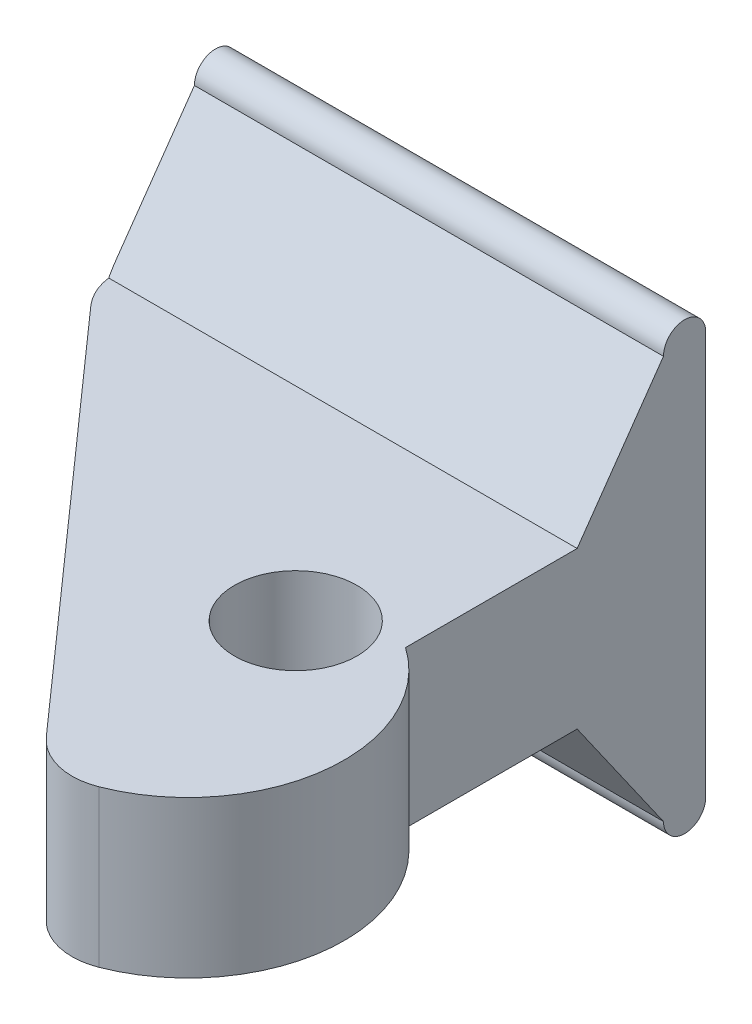
ISO-10303-21;
HEADER;
FILE_DESCRIPTION(('STEP AP214'),'2;1');
FILE_NAME('part.step','',(''),(''),'','','');
FILE_SCHEMA(('AUTOMOTIVE_DESIGN { 1 0 10303 214 1 1 1 1 }'));
ENDSEC;
DATA;
#1=APPLICATION_CONTEXT('core data for automotive mechanical design processes');
#2=APPLICATION_PROTOCOL_DEFINITION('international standard','automotive_design',2000,#1);
#3=PRODUCT_CONTEXT('',#1,'mechanical');
#4=PRODUCT('Part','Part','',(#3));
#5=PRODUCT_RELATED_PRODUCT_CATEGORY('part','',(#4));
#6=PRODUCT_DEFINITION_FORMATION('','',#4);
#7=PRODUCT_DEFINITION_CONTEXT('part definition',#1,'design');
#8=PRODUCT_DEFINITION('design','',#6,#7);
#9=PRODUCT_DEFINITION_SHAPE('','',#8);
#10=(LENGTH_UNIT() NAMED_UNIT(*) SI_UNIT(.MILLI.,.METRE.));
#11=(NAMED_UNIT(*) PLANE_ANGLE_UNIT() SI_UNIT($,.RADIAN.));
#12=(NAMED_UNIT(*) SI_UNIT($,.STERADIAN.) SOLID_ANGLE_UNIT());
#13=UNCERTAINTY_MEASURE_WITH_UNIT(LENGTH_MEASURE(1.E-05),#10,'distance_accuracy_value','');
#14=(GEOMETRIC_REPRESENTATION_CONTEXT(3) GLOBAL_UNCERTAINTY_ASSIGNED_CONTEXT((#13)) GLOBAL_UNIT_ASSIGNED_CONTEXT((#10,
#11,#12)) REPRESENTATION_CONTEXT('',''));
#15=CARTESIAN_POINT('',(0.,0.,0.));
#16=DIRECTION('',(0.,0.,1.));
#17=DIRECTION('',(1.,0.,0.));
#18=AXIS2_PLACEMENT_3D('',#15,#16,#17);
#19=CARTESIAN_POINT('',(12.7,6.35,0.));
#20=DIRECTION('',(-1.,0.,0.));
#21=DIRECTION('',(0.,0.,1.));
#22=AXIS2_PLACEMENT_3D('',#19,#20,#21);
#23=PLANE('',#22);
#24=DIRECTION('',(0.,0.,-1.));
#25=VECTOR('',#24,1.);
#26=CARTESIAN_POINT('',(12.7,0.,0.));
#27=LINE('',#26,#25);
#28=CARTESIAN_POINT('',(12.7,0.,6.35000000000004));
#29=VERTEX_POINT('',#28);
#30=CARTESIAN_POINT('',(12.7,0.,-0.620153491090818));
#31=VERTEX_POINT('',#30);
#32=EDGE_CURVE('E146',#29,#31,#27,.T.);
#33=ORIENTED_EDGE('',*,*,#32,.T.);
#34=DIRECTION('',(0.,-0.819152044288993,-0.573576436351044));
#35=VECTOR('',#34,1.);
#36=CARTESIAN_POINT('',(12.7,4.55229078472536,2.56739483249647));
#37=LINE('',#36,#35);
#38=CARTESIAN_POINT('',(12.7,-5.00602262218575,-4.12540826759358));
#39=VERTEX_POINT('',#38);
#40=EDGE_CURVE('E143',#31,#39,#37,.T.);
#41=ORIENTED_EDGE('',*,*,#40,.T.);
#42=CARTESIAN_POINT('',(12.7,-5.00602262218575,-4.98370413379679));
#43=DIRECTION('',(-1.,0.,0.));
#44=DIRECTION('',(0.,0.,1.));
#45=AXIS2_PLACEMENT_3D('',#42,#43,#44);
#46=CIRCLE('',#45,0.858295866203211);
#47=CARTESIAN_POINT('',(12.7,-5.00602262218575,-5.842));
#48=VERTEX_POINT('',#47);
#49=EDGE_CURVE('E134',#48,#39,#46,.T.);
#50=ORIENTED_EDGE('',*,*,#49,.F.);
#51=DIRECTION('',(0.,-1.,0.));
#52=VECTOR('',#51,1.);
#53=CARTESIAN_POINT('',(12.7,6.35,-5.842));
#54=LINE('',#53,#52);
#55=CARTESIAN_POINT('',(12.7,11.3560226221857,-5.842));
#56=VERTEX_POINT('',#55);
#57=EDGE_CURVE('E118',#56,#48,#54,.T.);
#58=ORIENTED_EDGE('',*,*,#57,.F.);
#59=CARTESIAN_POINT('',(12.7,11.3560226221857,-4.9837041337968));
#60=DIRECTION('',(-1.,0.,0.));
#61=DIRECTION('',(0.,0.,1.));
#62=AXIS2_PLACEMENT_3D('',#59,#60,#61);
#63=CIRCLE('',#62,0.858295866203201);
#64=CARTESIAN_POINT('',(12.7,11.3560226221857,-4.1254082675936));
#65=VERTEX_POINT('',#64);
#66=EDGE_CURVE('E128',#56,#65,#63,.F.);
#67=ORIENTED_EDGE('',*,*,#66,.T.);
#68=DIRECTION('',(0.,-0.819152044288991,0.573576436351047));
#69=VECTOR('',#68,1.);
#70=CARTESIAN_POINT('',(12.7,6.05862317033365,-0.416129238498795));
#71=LINE('',#70,#69);
#72=CARTESIAN_POINT('',(12.7,6.35,-0.620153491090819));
#73=VERTEX_POINT('',#72);
#74=EDGE_CURVE('E148',#65,#73,#71,.T.);
#75=ORIENTED_EDGE('',*,*,#74,.T.);
#76=DIRECTION('',(0.,0.,-1.));
#77=VECTOR('',#76,1.);
#78=CARTESIAN_POINT('',(12.7,6.35,0.));
#79=LINE('',#78,#77);
#80=CARTESIAN_POINT('',(12.7,6.35,6.35000000000004));
#81=VERTEX_POINT('',#80);
#82=EDGE_CURVE('E154',#81,#73,#79,.T.);
#83=ORIENTED_EDGE('',*,*,#82,.F.);
#84=DIRECTION('',(0.,-1.,0.));
#85=VECTOR('',#84,1.);
#86=CARTESIAN_POINT('',(12.7,6.35,6.35000000000004));
#87=LINE('',#86,#85);
#88=EDGE_CURVE('E155',#81,#29,#87,.T.);
#89=ORIENTED_EDGE('',*,*,#88,.T.);
#90=EDGE_LOOP('',(#33,#41,#50,#58,#67,#75,#83,#89));
#91=FACE_BOUND('',#90,.T.);
#92=ADVANCED_FACE('F36',(#91),#23,.F.);
#93=CARTESIAN_POINT('',(-6.35,12.9055102958205,0.));
#94=DIRECTION('',(1.,0.,0.));
#95=DIRECTION('',(0.,0.,-1.));
#96=AXIS2_PLACEMENT_3D('',#93,#94,#95);
#97=PLANE('',#96);
#98=DIRECTION('',(0.,0.819152044288993,0.573576436351044));
#99=VECTOR('',#98,1.);
#100=CARTESIAN_POINT('',(-6.35,8.95110421811033,5.64747715773074));
#101=LINE('',#100,#99);
#102=CARTESIAN_POINT('',(-6.35,-5.00602262218575,-4.12540826759358));
#103=VERTEX_POINT('',#102);
#104=CARTESIAN_POINT('',(-6.35,-0.491776970305034,-0.964499432816318));
#105=VERTEX_POINT('',#104);
#106=EDGE_CURVE('E164',#103,#105,#101,.T.);
#107=ORIENTED_EDGE('',*,*,#106,.T.);
#108=DIRECTION('',(0.,-1.,0.));
#109=VECTOR('',#108,1.);
#110=CARTESIAN_POINT('',(-6.35,12.9055102958205,-0.964499432816318));
#111=LINE('',#110,#109);
#112=CARTESIAN_POINT('',(-6.35,6.841776970305,-0.964499432816317));
#113=VERTEX_POINT('',#112);
#114=EDGE_CURVE('E44',#105,#113,#111,.F.);
#115=ORIENTED_EDGE('',*,*,#114,.T.);
#116=DIRECTION('',(0.,0.819152044288991,-0.573576436351047));
#117=VECTOR('',#116,1.);
#118=CARTESIAN_POINT('',(-6.35,10.4574366037186,-3.4962115637331));
#119=LINE('',#118,#117);
#120=CARTESIAN_POINT('',(-6.35,11.3560226221857,-4.1254082675936));
#121=VERTEX_POINT('',#120);
#122=EDGE_CURVE('E161',#113,#121,#119,.T.);
#123=ORIENTED_EDGE('',*,*,#122,.T.);
#124=CARTESIAN_POINT('',(-6.35,11.3560226221857,-4.9837041337968));
#125=DIRECTION('',(-1.,0.,0.));
#126=DIRECTION('',(0.,0.,1.));
#127=AXIS2_PLACEMENT_3D('',#124,#125,#126);
#128=CIRCLE('',#127,0.858295866203201);
#129=CARTESIAN_POINT('',(-6.35,11.3560226221857,-5.842));
#130=VERTEX_POINT('',#129);
#131=EDGE_CURVE('E163',#121,#130,#128,.T.);
#132=ORIENTED_EDGE('',*,*,#131,.T.);
#133=DIRECTION('',(0.,1.,0.));
#134=VECTOR('',#133,1.);
#135=CARTESIAN_POINT('',(-6.35,0.,-5.842));
#136=LINE('',#135,#134);
#137=CARTESIAN_POINT('',(-6.35,-5.00602262218575,-5.842));
#138=VERTEX_POINT('',#137);
#139=EDGE_CURVE('E160',#138,#130,#136,.T.);
#140=ORIENTED_EDGE('',*,*,#139,.F.);
#141=CARTESIAN_POINT('',(-6.35,-5.00602262218575,-4.98370413379679));
#142=DIRECTION('',(-1.,0.,0.));
#143=DIRECTION('',(0.,0.,1.));
#144=AXIS2_PLACEMENT_3D('',#141,#142,#143);
#145=CIRCLE('',#144,0.858295866203211);
#146=EDGE_CURVE('E137',#103,#138,#145,.F.);
#147=ORIENTED_EDGE('',*,*,#146,.F.);
#148=EDGE_LOOP('',(#107,#115,#123,#132,#140,#147));
#149=FACE_BOUND('',#148,.T.);
#150=ADVANCED_FACE('F238',(#149),#97,.F.);
#151=CARTESIAN_POINT('',(9.06408672353238,6.35,11.5560190785289));
#152=DIRECTION('',(0.,1.,0.));
#153=DIRECTION('',(0.,0.,1.));
#154=AXIS2_PLACEMENT_3D('',#151,#152,#153);
#155=PLANE('',#154);
#156=DIRECTION('',(-0.663742969789503,0.,-0.747960740985121));
#157=VECTOR('',#156,1.);
#158=CARTESIAN_POINT('',(6.17777705205215,6.35,14.117340345949));
#159=LINE('',#158,#157);
#160=CARTESIAN_POINT('',(8.55028345385277,6.35,16.790877734745));
#161=VERTEX_POINT('',#160);
#162=CARTESIAN_POINT('',(-5.7098202821022,6.35,0.721407710449019));
#163=VERTEX_POINT('',#162);
#164=EDGE_CURVE('E174',#161,#163,#159,.T.);
#165=ORIENTED_EDGE('',*,*,#164,.F.);
#166=CARTESIAN_POINT('',(10.450103735955,6.35,15.1049705914796));
#167=DIRECTION('',(0.,1.,0.));
#168=DIRECTION('',(0.,0.,1.));
#169=AXIS2_PLACEMENT_3D('',#166,#167,#168);
#170=CIRCLE('',#169,2.54);
#171=CARTESIAN_POINT('',(11.37411507757,6.35,17.4709382667801));
#172=VERTEX_POINT('',#171);
#173=EDGE_CURVE('E188',#161,#172,#170,.T.);
#174=ORIENTED_EDGE('',*,*,#173,.T.);
#175=CARTESIAN_POINT('',(9.06408672353238,6.35,11.5560190785289));
#176=DIRECTION('',(0.,1.,0.));
#177=DIRECTION('',(0.,0.,1.));
#178=AXIS2_PLACEMENT_3D('',#175,#176,#177);
#179=CIRCLE('',#178,6.35);
#180=EDGE_CURVE('E152',#172,#81,#179,.T.);
#181=ORIENTED_EDGE('',*,*,#180,.T.);
#182=ORIENTED_EDGE('',*,*,#82,.T.);
#183=DIRECTION('',(-1.,0.,0.));
#184=VECTOR('',#183,1.);
#185=CARTESIAN_POINT('',(15.4140867235324,6.35,-0.620153491090819));
#186=LINE('',#185,#184);
#187=CARTESIAN_POINT('',(-6.32655039139238,6.35,-0.620153491090819));
#188=VERTEX_POINT('',#187);
#189=EDGE_CURVE('E222',#73,#188,#186,.T.);
#190=ORIENTED_EDGE('',*,*,#189,.T.);
#191=CARTESIAN_POINT('',(-3.81,6.35,-0.964499432816318));
#192=DIRECTION('',(0.,1.,0.));
#193=DIRECTION('',(0.,0.,1.));
#194=AXIS2_PLACEMENT_3D('',#191,#192,#193);
#195=CIRCLE('',#194,2.54);
#196=EDGE_CURVE('E186',#188,#163,#195,.T.);
#197=ORIENTED_EDGE('',*,*,#196,.T.);
#198=EDGE_LOOP('',(#165,#174,#181,#182,#190,#197));
#199=FACE_BOUND('',#198,.T.);
#200=CARTESIAN_POINT('',(9.52499999999998,6.35,7.63484650890918));
#201=DIRECTION('',(0.,1.,0.));
#202=DIRECTION('',(0.,0.,1.));
#203=AXIS2_PLACEMENT_3D('',#200,#201,#202);
#204=CIRCLE('',#203,2.4892);
#205=CARTESIAN_POINT('',(9.52499999999998,6.35,10.1240465089092));
#206=VERTEX_POINT('',#205);
#207=EDGE_CURVE('E139',#206,#206,#204,.T.);
#208=ORIENTED_EDGE('',*,*,#207,.F.);
#209=EDGE_LOOP('',(#208));
#210=FACE_BOUND('',#209,.T.);
#211=ADVANCED_FACE('F194',(#199,#210),#155,.T.);
#212=CARTESIAN_POINT('',(9.06408672353238,0.,11.5560190785289));
#213=DIRECTION('',(0.,1.,0.));
#214=DIRECTION('',(0.,0.,1.));
#215=AXIS2_PLACEMENT_3D('',#212,#213,#214);
#216=PLANE('',#215);
#217=CARTESIAN_POINT('',(9.52499999999998,0.,7.63484650890918));
#218=DIRECTION('',(0.,1.,0.));
#219=DIRECTION('',(0.,0.,1.));
#220=AXIS2_PLACEMENT_3D('',#217,#218,#219);
#221=CIRCLE('',#220,2.4892);
#222=CARTESIAN_POINT('',(9.52499999999998,0.,10.1240465089092));
#223=VERTEX_POINT('',#222);
#224=EDGE_CURVE('E171',#223,#223,#221,.T.);
#225=ORIENTED_EDGE('',*,*,#224,.T.);
#226=EDGE_LOOP('',(#225));
#227=FACE_BOUND('',#226,.T.);
#228=CARTESIAN_POINT('',(9.06408672353238,0.,11.5560190785289));
#229=DIRECTION('',(0.,1.,0.));
#230=DIRECTION('',(0.,0.,1.));
#231=AXIS2_PLACEMENT_3D('',#228,#229,#230);
#232=CIRCLE('',#231,6.35);
#233=CARTESIAN_POINT('',(11.37411507757,0.,17.4709382667801));
#234=VERTEX_POINT('',#233);
#235=EDGE_CURVE('E144',#234,#29,#232,.T.);
#236=ORIENTED_EDGE('',*,*,#235,.F.);
#237=CARTESIAN_POINT('',(10.450103735955,0.,15.1049705914796));
#238=DIRECTION('',(0.,1.,0.));
#239=DIRECTION('',(0.,0.,1.));
#240=AXIS2_PLACEMENT_3D('',#237,#238,#239);
#241=CIRCLE('',#240,2.54);
#242=CARTESIAN_POINT('',(8.55028345385277,0.,16.790877734745));
#243=VERTEX_POINT('',#242);
#244=EDGE_CURVE('E179',#234,#243,#241,.F.);
#245=ORIENTED_EDGE('',*,*,#244,.T.);
#246=DIRECTION('',(-0.663742969789503,0.,-0.747960740985121));
#247=VECTOR('',#246,1.);
#248=CARTESIAN_POINT('',(6.17777705205215,0.,14.117340345949));
#249=LINE('',#248,#247);
#250=CARTESIAN_POINT('',(-5.7098202821022,0.,0.721407710449019));
#251=VERTEX_POINT('',#250);
#252=EDGE_CURVE('E210',#243,#251,#249,.T.);
#253=ORIENTED_EDGE('',*,*,#252,.T.);
#254=CARTESIAN_POINT('',(-3.81,0.,-0.964499432816318));
#255=DIRECTION('',(0.,1.,0.));
#256=DIRECTION('',(0.,0.,1.));
#257=AXIS2_PLACEMENT_3D('',#254,#255,#256);
#258=CIRCLE('',#257,2.54);
#259=CARTESIAN_POINT('',(-6.32655039139238,0.,-0.620153491090818));
#260=VERTEX_POINT('',#259);
#261=EDGE_CURVE('E177',#251,#260,#258,.F.);
#262=ORIENTED_EDGE('',*,*,#261,.T.);
#263=DIRECTION('',(-1.,0.,0.));
#264=VECTOR('',#263,1.);
#265=CARTESIAN_POINT('',(15.4140867235324,0.,-0.620153491090818));
#266=LINE('',#265,#264);
#267=EDGE_CURVE('E220',#31,#260,#266,.T.);
#268=ORIENTED_EDGE('',*,*,#267,.F.);
#269=ORIENTED_EDGE('',*,*,#32,.F.);
#270=EDGE_LOOP('',(#236,#245,#253,#262,#268,#269));
#271=FACE_BOUND('',#270,.T.);
#272=ADVANCED_FACE('F209',(#227,#271),#216,.F.);
#273=CARTESIAN_POINT('',(9.06408672353238,6.35,11.5560190785289));
#274=DIRECTION('',(0.,-1.,0.));
#275=DIRECTION('',(0.,0.,-1.));
#276=AXIS2_PLACEMENT_3D('',#273,#274,#275);
#277=CYLINDRICAL_SURFACE('',#276,6.35);
#278=ORIENTED_EDGE('',*,*,#180,.F.);
#279=DIRECTION('',(0.,-1.,0.));
#280=VECTOR('',#279,1.);
#281=CARTESIAN_POINT('',(11.37411507757,6.35,17.4709382667801));
#282=LINE('',#281,#280);
#283=EDGE_CURVE('E166',#172,#234,#282,.T.);
#284=ORIENTED_EDGE('',*,*,#283,.T.);
#285=ORIENTED_EDGE('',*,*,#235,.T.);
#286=ORIENTED_EDGE('',*,*,#88,.F.);
#287=EDGE_LOOP('',(#278,#284,#285,#286));
#288=FACE_BOUND('',#287,.T.);
#289=ADVANCED_FACE('F203',(#288),#277,.T.);
#290=CARTESIAN_POINT('',(15.4140867235324,-5.00602262218575,-4.98370413379679));
#291=DIRECTION('',(-1.,0.,0.));
#292=DIRECTION('',(0.,0.,1.));
#293=AXIS2_PLACEMENT_3D('',#290,#291,#292);
#294=CYLINDRICAL_SURFACE('',#293,0.858295866203211);
#295=ORIENTED_EDGE('',*,*,#49,.T.);
#296=DIRECTION('',(-1.,0.,0.));
#297=VECTOR('',#296,1.);
#298=CARTESIAN_POINT('',(15.4140867235324,-5.00602262218575,-4.12540826759358));
#299=LINE('',#298,#297);
#300=EDGE_CURVE('E129',#39,#103,#299,.T.);
#301=ORIENTED_EDGE('',*,*,#300,.T.);
#302=ORIENTED_EDGE('',*,*,#146,.T.);
#303=DIRECTION('',(-1.,0.,0.));
#304=VECTOR('',#303,1.);
#305=CARTESIAN_POINT('',(15.4140867235324,-5.00602262218575,-5.842));
#306=LINE('',#305,#304);
#307=EDGE_CURVE('E121',#48,#138,#306,.T.);
#308=ORIENTED_EDGE('',*,*,#307,.F.);
#309=EDGE_LOOP('',(#295,#301,#302,#308));
#310=FACE_BOUND('',#309,.T.);
#311=ADVANCED_FACE('F132',(#310),#294,.T.);
#312=CARTESIAN_POINT('',(15.4140867235324,0.291376829666324,-0.416129238498799));
#313=DIRECTION('',(0.,0.573576436351044,-0.819152044288993));
#314=DIRECTION('',(0.,0.819152044288993,0.573576436351044));
#315=AXIS2_PLACEMENT_3D('',#312,#313,#314);
#316=PLANE('',#315);
#317=ORIENTED_EDGE('',*,*,#267,.T.);
#318=CARTESIAN_POINT('',(-3.81,-0.491776970305031,-0.964499432816318));
#319=DIRECTION('',(0.,0.573576436351044,-0.819152044288993));
#320=DIRECTION('',(0.,-0.819152044288993,-0.573576436351044));
#321=AXIS2_PLACEMENT_3D('',#318,#319,#320);
#322=ELLIPSE('',#321,4.42835486087761,2.54);
#323=EDGE_CURVE('E58',#260,#105,#322,.F.);
#324=ORIENTED_EDGE('',*,*,#323,.T.);
#325=ORIENTED_EDGE('',*,*,#106,.F.);
#326=ORIENTED_EDGE('',*,*,#300,.F.);
#327=ORIENTED_EDGE('',*,*,#40,.F.);
#328=EDGE_LOOP('',(#317,#324,#325,#326,#327));
#329=FACE_BOUND('',#328,.T.);
#330=ADVANCED_FACE('F243',(#329),#316,.F.);
#331=CARTESIAN_POINT('',(15.4140867235324,1.79770921527467,2.56739483249645));
#332=DIRECTION('',(0.,-0.573576436351047,-0.819152044288991));
#333=DIRECTION('',(0.,0.819152044288991,-0.573576436351047));
#334=AXIS2_PLACEMENT_3D('',#331,#332,#333);
#335=PLANE('',#334);
#336=ORIENTED_EDGE('',*,*,#122,.F.);
#337=CARTESIAN_POINT('',(-3.81,6.841776970305,-0.964499432816318));
#338=DIRECTION('',(0.,-0.573576436351047,-0.819152044288991));
#339=DIRECTION('',(0.,-0.819152044288991,0.573576436351047));
#340=AXIS2_PLACEMENT_3D('',#337,#338,#339);
#341=ELLIPSE('',#340,4.42835486087758,2.54);
#342=EDGE_CURVE('E11',#113,#188,#341,.F.);
#343=ORIENTED_EDGE('',*,*,#342,.T.);
#344=ORIENTED_EDGE('',*,*,#189,.F.);
#345=ORIENTED_EDGE('',*,*,#74,.F.);
#346=DIRECTION('',(-1.,0.,0.));
#347=VECTOR('',#346,1.);
#348=CARTESIAN_POINT('',(15.4140867235324,11.3560226221857,-4.1254082675936));
#349=LINE('',#348,#347);
#350=EDGE_CURVE('E224',#65,#121,#349,.T.);
#351=ORIENTED_EDGE('',*,*,#350,.T.);
#352=EDGE_LOOP('',(#336,#343,#344,#345,#351));
#353=FACE_BOUND('',#352,.T.);
#354=ADVANCED_FACE('F234',(#353),#335,.F.);
#355=CARTESIAN_POINT('',(15.4140867235324,11.3560226221857,-4.9837041337968));
#356=DIRECTION('',(-1.,0.,0.));
#357=DIRECTION('',(0.,0.,1.));
#358=AXIS2_PLACEMENT_3D('',#355,#356,#357);
#359=CYLINDRICAL_SURFACE('',#358,0.858295866203201);
#360=DIRECTION('',(-1.,0.,0.));
#361=VECTOR('',#360,1.);
#362=CARTESIAN_POINT('',(15.4140867235324,11.3560226221857,-5.842));
#363=LINE('',#362,#361);
#364=EDGE_CURVE('E124',#56,#130,#363,.T.);
#365=ORIENTED_EDGE('',*,*,#364,.T.);
#366=ORIENTED_EDGE('',*,*,#131,.F.);
#367=ORIENTED_EDGE('',*,*,#350,.F.);
#368=ORIENTED_EDGE('',*,*,#66,.F.);
#369=EDGE_LOOP('',(#365,#366,#367,#368));
#370=FACE_BOUND('',#369,.T.);
#371=ADVANCED_FACE('F237',(#370),#359,.T.);
#372=CARTESIAN_POINT('',(15.4140867235324,0.,-5.842));
#373=DIRECTION('',(0.,0.,-1.));
#374=DIRECTION('',(0.,1.,0.));
#375=AXIS2_PLACEMENT_3D('',#372,#373,#374);
#376=PLANE('',#375);
#377=ORIENTED_EDGE('',*,*,#57,.T.);
#378=ORIENTED_EDGE('',*,*,#307,.T.);
#379=ORIENTED_EDGE('',*,*,#139,.T.);
#380=ORIENTED_EDGE('',*,*,#364,.F.);
#381=EDGE_LOOP('',(#377,#378,#379,#380));
#382=FACE_BOUND('',#381,.T.);
#383=ADVANCED_FACE('F120',(#382),#376,.T.);
#384=CARTESIAN_POINT('',(9.52499999999998,-5.86431848838896,7.63484650890918));
#385=DIRECTION('',(0.,1.,0.));
#386=DIRECTION('',(0.,0.,1.));
#387=AXIS2_PLACEMENT_3D('',#384,#385,#386);
#388=CYLINDRICAL_SURFACE('',#387,2.4892);
#389=ORIENTED_EDGE('',*,*,#207,.T.);
#390=EDGE_LOOP('',(#389));
#391=FACE_BOUND('',#390,.T.);
#392=ORIENTED_EDGE('',*,*,#224,.F.);
#393=EDGE_LOOP('',(#392));
#394=FACE_BOUND('',#393,.T.);
#395=ADVANCED_FACE('F268',(#391,#394),#388,.F.);
#396=CARTESIAN_POINT('',(9.52499999999998,-5.86431848838896,17.889269346091));
#397=DIRECTION('',(0.747960740985121,0.,-0.663742969789503));
#398=DIRECTION('',(-0.663742969789503,0.,-0.747960740985121));
#399=AXIS2_PLACEMENT_3D('',#396,#397,#398);
#400=PLANE('',#399);
#401=ORIENTED_EDGE('',*,*,#252,.F.);
#402=DIRECTION('',(0.,-1.,0.));
#403=VECTOR('',#402,1.);
#404=CARTESIAN_POINT('',(8.55028345385277,-5.86431848838896,16.790877734745));
#405=LINE('',#404,#403);
#406=EDGE_CURVE('E184',#243,#161,#405,.F.);
#407=ORIENTED_EDGE('',*,*,#406,.T.);
#408=ORIENTED_EDGE('',*,*,#164,.T.);
#409=DIRECTION('',(0.,-1.,0.));
#410=VECTOR('',#409,1.);
#411=CARTESIAN_POINT('',(-5.7098202821022,-5.86431848838896,0.721407710449019));
#412=LINE('',#411,#410);
#413=EDGE_CURVE('E181',#163,#251,#412,.T.);
#414=ORIENTED_EDGE('',*,*,#413,.T.);
#415=EDGE_LOOP('',(#401,#407,#408,#414));
#416=FACE_BOUND('',#415,.T.);
#417=ADVANCED_FACE('F213',(#416),#400,.F.);
#418=CARTESIAN_POINT('',(10.450103735955,6.35,15.1049705914796));
#419=DIRECTION('',(0.,-1.,0.));
#420=DIRECTION('',(0.,0.,-1.));
#421=AXIS2_PLACEMENT_3D('',#418,#419,#420);
#422=CYLINDRICAL_SURFACE('',#421,2.54);
#423=ORIENTED_EDGE('',*,*,#173,.F.);
#424=ORIENTED_EDGE('',*,*,#406,.F.);
#425=ORIENTED_EDGE('',*,*,#244,.F.);
#426=ORIENTED_EDGE('',*,*,#283,.F.);
#427=EDGE_LOOP('',(#423,#424,#425,#426));
#428=FACE_BOUND('',#427,.T.);
#429=ADVANCED_FACE('F205',(#428),#422,.T.);
#430=CARTESIAN_POINT('',(-3.81,-5.86431848838896,-0.964499432816318));
#431=DIRECTION('',(0.,-1.,0.));
#432=DIRECTION('',(0.,0.,-1.));
#433=AXIS2_PLACEMENT_3D('',#430,#431,#432);
#434=CYLINDRICAL_SURFACE('',#433,2.54);
#435=ORIENTED_EDGE('',*,*,#342,.F.);
#436=ORIENTED_EDGE('',*,*,#114,.F.);
#437=ORIENTED_EDGE('',*,*,#323,.F.);
#438=ORIENTED_EDGE('',*,*,#261,.F.);
#439=ORIENTED_EDGE('',*,*,#413,.F.);
#440=ORIENTED_EDGE('',*,*,#196,.F.);
#441=EDGE_LOOP('',(#435,#436,#437,#438,#439,#440));
#442=FACE_BOUND('',#441,.T.);
#443=ADVANCED_FACE('F38',(#442),#434,.T.);
#444=CLOSED_SHELL('',(#92,#150,#211,#272,#289,#311,#330,#354,#371,#383,#395,#417,#429,#443));
#445=MANIFOLD_SOLID_BREP('B2',#444);
#446=ADVANCED_BREP_SHAPE_REPRESENTATION('',(#18,#445),#14);
#447=SHAPE_DEFINITION_REPRESENTATION(#9,#446);
ENDSEC;
END-ISO-10303-21;
